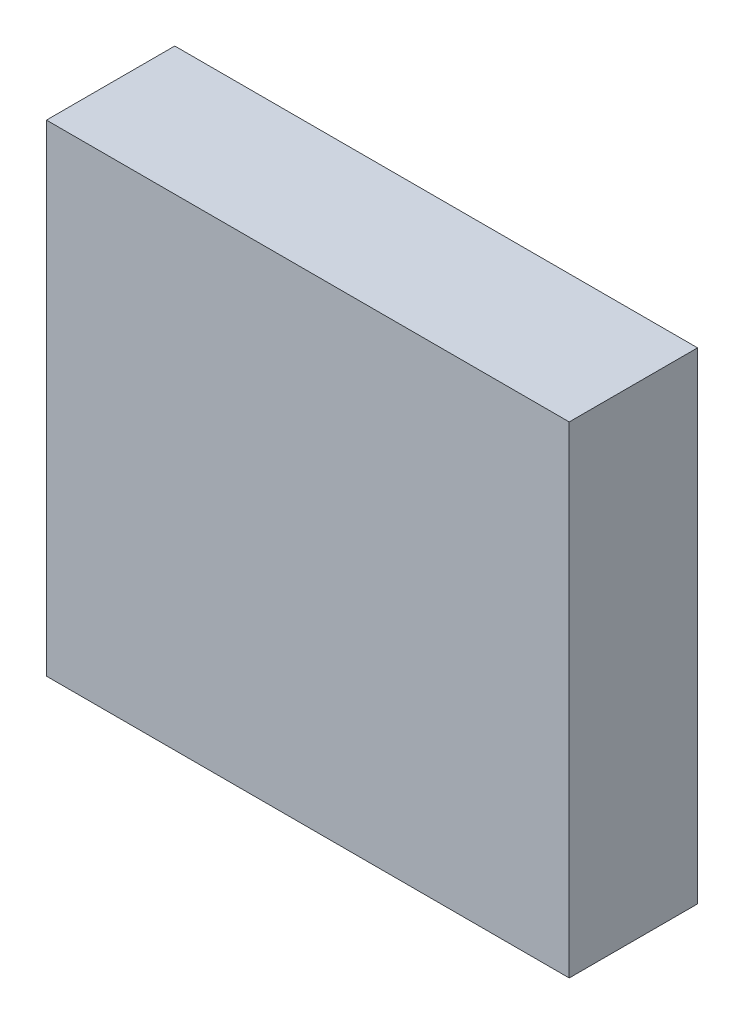
ISO-10303-21;
HEADER;
FILE_DESCRIPTION(('STEP AP214'),'2;1');
FILE_NAME('part.step','',(''),(''),'','','');
FILE_SCHEMA(('AUTOMOTIVE_DESIGN { 1 0 10303 214 1 1 1 1 }'));
ENDSEC;
DATA;
#1=APPLICATION_CONTEXT('core data for automotive mechanical design processes');
#2=APPLICATION_PROTOCOL_DEFINITION('international standard','automotive_design',2000,#1);
#3=PRODUCT_CONTEXT('',#1,'mechanical');
#4=PRODUCT('Part','Part','',(#3));
#5=PRODUCT_RELATED_PRODUCT_CATEGORY('part','',(#4));
#6=PRODUCT_DEFINITION_FORMATION('','',#4);
#7=PRODUCT_DEFINITION_CONTEXT('part definition',#1,'design');
#8=PRODUCT_DEFINITION('design','',#6,#7);
#9=PRODUCT_DEFINITION_SHAPE('','',#8);
#10=(LENGTH_UNIT() NAMED_UNIT(*) SI_UNIT(.MILLI.,.METRE.));
#11=(NAMED_UNIT(*) PLANE_ANGLE_UNIT() SI_UNIT($,.RADIAN.));
#12=(NAMED_UNIT(*) SI_UNIT($,.STERADIAN.) SOLID_ANGLE_UNIT());
#13=UNCERTAINTY_MEASURE_WITH_UNIT(LENGTH_MEASURE(1.E-05),#10,'distance_accuracy_value','');
#14=(GEOMETRIC_REPRESENTATION_CONTEXT(3) GLOBAL_UNCERTAINTY_ASSIGNED_CONTEXT((#13)) GLOBAL_UNIT_ASSIGNED_CONTEXT((#10,
#11,#12)) REPRESENTATION_CONTEXT('',''));
#15=CARTESIAN_POINT('',(0.,0.,0.));
#16=DIRECTION('',(0.,0.,1.));
#17=DIRECTION('',(1.,0.,0.));
#18=AXIS2_PLACEMENT_3D('',#15,#16,#17);
#19=CARTESIAN_POINT('',(49.34098336,37.15426656,1.541526));
#20=DIRECTION('',(0.,0.,1.));
#21=DIRECTION('',(0.,1.,0.));
#22=AXIS2_PLACEMENT_3D('',#19,#20,#21);
#23=PLANE('',#22);
#24=DIRECTION('',(0.,1.,0.));
#25=VECTOR('',#24,1.);
#26=CARTESIAN_POINT('',(45.975016,38.735,1.541526));
#27=LINE('',#26,#25);
#28=CARTESIAN_POINT('',(45.975016,40.254936,1.541526));
#29=VERTEX_POINT('',#28);
#30=CARTESIAN_POINT('',(45.975016,37.215064,1.541526));
#31=VERTEX_POINT('',#30);
#32=EDGE_CURVE('E76',#29,#31,#27,.F.);
#33=ORIENTED_EDGE('',*,*,#32,.T.);
#34=DIRECTION('',(-1.,0.,0.));
#35=VECTOR('',#34,1.);
#36=CARTESIAN_POINT('',(47.625,37.215064,1.541526));
#37=LINE('',#36,#35);
#38=CARTESIAN_POINT('',(49.274984,37.215064,1.541526));
#39=VERTEX_POINT('',#38);
#40=EDGE_CURVE('E58',#31,#39,#37,.F.);
#41=ORIENTED_EDGE('',*,*,#40,.T.);
#42=DIRECTION('',(0.,-1.,0.));
#43=VECTOR('',#42,1.);
#44=CARTESIAN_POINT('',(49.274984,38.735,1.541526));
#45=LINE('',#44,#43);
#46=CARTESIAN_POINT('',(49.274984,40.254936,1.541526));
#47=VERTEX_POINT('',#46);
#48=EDGE_CURVE('E20',#39,#47,#45,.F.);
#49=ORIENTED_EDGE('',*,*,#48,.T.);
#50=DIRECTION('',(1.,0.,0.));
#51=VECTOR('',#50,1.);
#52=CARTESIAN_POINT('',(47.625,40.254936,1.541526));
#53=LINE('',#52,#51);
#54=EDGE_CURVE('E55',#47,#29,#53,.F.);
#55=ORIENTED_EDGE('',*,*,#54,.T.);
#56=EDGE_LOOP('',(#33,#41,#49,#55));
#57=FACE_BOUND('',#56,.T.);
#58=ADVANCED_FACE('F16',(#57),#23,.T.);
#59=CARTESIAN_POINT('',(49.274984,37.15426656,0.71531988));
#60=DIRECTION('',(1.,0.,0.));
#61=DIRECTION('',(0.,1.,0.));
#62=AXIS2_PLACEMENT_3D('',#59,#60,#61);
#63=PLANE('',#62);
#64=ORIENTED_EDGE('',*,*,#48,.F.);
#65=DIRECTION('',(0.,0.,1.));
#66=VECTOR('',#65,1.);
#67=CARTESIAN_POINT('',(49.274984,37.215064,1.136523));
#68=LINE('',#67,#66);
#69=CARTESIAN_POINT('',(49.274984,37.215064,0.73152));
#70=VERTEX_POINT('',#69);
#71=EDGE_CURVE('E80',#39,#70,#68,.F.);
#72=ORIENTED_EDGE('',*,*,#71,.T.);
#73=DIRECTION('',(0.,1.,0.));
#74=VECTOR('',#73,1.);
#75=CARTESIAN_POINT('',(49.274984,38.735,0.73152));
#76=LINE('',#75,#74);
#77=CARTESIAN_POINT('',(49.274984,40.254936,0.73152));
#78=VERTEX_POINT('',#77);
#79=EDGE_CURVE('E73',#70,#78,#76,.T.);
#80=ORIENTED_EDGE('',*,*,#79,.T.);
#81=DIRECTION('',(0.,0.,-1.));
#82=VECTOR('',#81,1.);
#83=CARTESIAN_POINT('',(49.274984,40.254936,1.136523));
#84=LINE('',#83,#82);
#85=EDGE_CURVE('E63',#78,#47,#84,.F.);
#86=ORIENTED_EDGE('',*,*,#85,.T.);
#87=EDGE_LOOP('',(#64,#72,#80,#86));
#88=FACE_BOUND('',#87,.T.);
#89=ADVANCED_FACE('F72',(#88),#63,.T.);
#90=CARTESIAN_POINT('',(49.34098336,40.254936,0.71531988));
#91=DIRECTION('',(0.,1.,0.));
#92=DIRECTION('',(-1.,0.,0.));
#93=AXIS2_PLACEMENT_3D('',#90,#91,#92);
#94=PLANE('',#93);
#95=ORIENTED_EDGE('',*,*,#54,.F.);
#96=ORIENTED_EDGE('',*,*,#85,.F.);
#97=DIRECTION('',(-1.,0.,0.));
#98=VECTOR('',#97,1.);
#99=CARTESIAN_POINT('',(47.625,40.254936,0.73152));
#100=LINE('',#99,#98);
#101=CARTESIAN_POINT('',(45.975016,40.254936,0.73152));
#102=VERTEX_POINT('',#101);
#103=EDGE_CURVE('E83',#78,#102,#100,.T.);
#104=ORIENTED_EDGE('',*,*,#103,.T.);
#105=DIRECTION('',(0.,0.,-1.));
#106=VECTOR('',#105,1.);
#107=CARTESIAN_POINT('',(45.975016,40.254936,1.136523));
#108=LINE('',#107,#106);
#109=EDGE_CURVE('E69',#102,#29,#108,.F.);
#110=ORIENTED_EDGE('',*,*,#109,.T.);
#111=EDGE_LOOP('',(#95,#96,#104,#110));
#112=FACE_BOUND('',#111,.T.);
#113=ADVANCED_FACE('F66',(#112),#94,.T.);
#114=CARTESIAN_POINT('',(45.975016,40.31573344,0.71531988));
#115=DIRECTION('',(-1.,0.,0.));
#116=DIRECTION('',(0.,-1.,0.));
#117=AXIS2_PLACEMENT_3D('',#114,#115,#116);
#118=PLANE('',#117);
#119=ORIENTED_EDGE('',*,*,#32,.F.);
#120=ORIENTED_EDGE('',*,*,#109,.F.);
#121=DIRECTION('',(0.,-1.,0.));
#122=VECTOR('',#121,1.);
#123=CARTESIAN_POINT('',(45.975016,38.735,0.73152));
#124=LINE('',#123,#122);
#125=CARTESIAN_POINT('',(45.975016,37.215064,0.73152));
#126=VERTEX_POINT('',#125);
#127=EDGE_CURVE('E26',#102,#126,#124,.T.);
#128=ORIENTED_EDGE('',*,*,#127,.T.);
#129=DIRECTION('',(0.,0.,-1.));
#130=VECTOR('',#129,1.);
#131=CARTESIAN_POINT('',(45.975016,37.215064,1.136523));
#132=LINE('',#131,#130);
#133=EDGE_CURVE('E34',#126,#31,#132,.F.);
#134=ORIENTED_EDGE('',*,*,#133,.T.);
#135=EDGE_LOOP('',(#119,#120,#128,#134));
#136=FACE_BOUND('',#135,.T.);
#137=ADVANCED_FACE('F88',(#136),#118,.T.);
#138=CARTESIAN_POINT('',(45.90901664,37.215064,0.71531988));
#139=DIRECTION('',(0.,-1.,0.));
#140=DIRECTION('',(1.,0.,0.));
#141=AXIS2_PLACEMENT_3D('',#138,#139,#140);
#142=PLANE('',#141);
#143=ORIENTED_EDGE('',*,*,#40,.F.);
#144=ORIENTED_EDGE('',*,*,#133,.F.);
#145=DIRECTION('',(1.,0.,0.));
#146=VECTOR('',#145,1.);
#147=CARTESIAN_POINT('',(47.625,37.215064,0.73152));
#148=LINE('',#147,#146);
#149=EDGE_CURVE('E11',#126,#70,#148,.T.);
#150=ORIENTED_EDGE('',*,*,#149,.T.);
#151=ORIENTED_EDGE('',*,*,#71,.F.);
#152=EDGE_LOOP('',(#143,#144,#150,#151));
#153=FACE_BOUND('',#152,.T.);
#154=ADVANCED_FACE('F90',(#153),#142,.T.);
#155=CARTESIAN_POINT('',(49.34098336,37.15426656,0.73152));
#156=DIRECTION('',(0.,0.,1.));
#157=DIRECTION('',(0.,1.,0.));
#158=AXIS2_PLACEMENT_3D('',#155,#156,#157);
#159=PLANE('',#158);
#160=ORIENTED_EDGE('',*,*,#127,.F.);
#161=ORIENTED_EDGE('',*,*,#103,.F.);
#162=ORIENTED_EDGE('',*,*,#79,.F.);
#163=ORIENTED_EDGE('',*,*,#149,.F.);
#164=EDGE_LOOP('',(#160,#161,#162,#163));
#165=FACE_BOUND('',#164,.T.);
#166=ADVANCED_FACE('F18',(#165),#159,.F.);
#167=CLOSED_SHELL('',(#58,#89,#113,#137,#154,#166));
#168=MANIFOLD_SOLID_BREP('B1',#167);
#169=ADVANCED_BREP_SHAPE_REPRESENTATION('',(#18,#168),#14);
#170=SHAPE_DEFINITION_REPRESENTATION(#9,#169);
ENDSEC;
END-ISO-10303-21;
